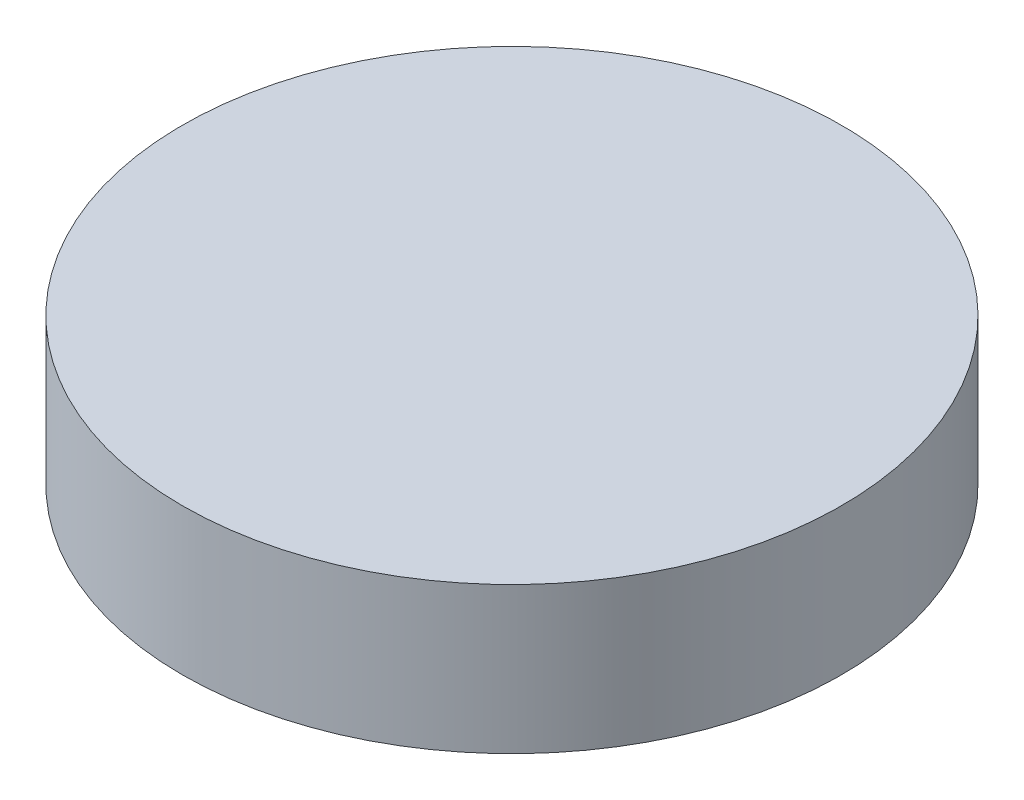
ISO-10303-21;
HEADER;
FILE_DESCRIPTION(('STEP AP214'),'2;1');
FILE_NAME('part.step','',(''),(''),'','','');
FILE_SCHEMA(('AUTOMOTIVE_DESIGN { 1 0 10303 214 1 1 1 1 }'));
ENDSEC;
DATA;
#1=APPLICATION_CONTEXT('core data for automotive mechanical design processes');
#2=APPLICATION_PROTOCOL_DEFINITION('international standard','automotive_design',2000,#1);
#3=PRODUCT_CONTEXT('',#1,'mechanical');
#4=PRODUCT('Part','Part','',(#3));
#5=PRODUCT_RELATED_PRODUCT_CATEGORY('part','',(#4));
#6=PRODUCT_DEFINITION_FORMATION('','',#4);
#7=PRODUCT_DEFINITION_CONTEXT('part definition',#1,'design');
#8=PRODUCT_DEFINITION('design','',#6,#7);
#9=PRODUCT_DEFINITION_SHAPE('','',#8);
#10=(LENGTH_UNIT() NAMED_UNIT(*) SI_UNIT(.MILLI.,.METRE.));
#11=(NAMED_UNIT(*) PLANE_ANGLE_UNIT() SI_UNIT($,.RADIAN.));
#12=(NAMED_UNIT(*) SI_UNIT($,.STERADIAN.) SOLID_ANGLE_UNIT());
#13=UNCERTAINTY_MEASURE_WITH_UNIT(LENGTH_MEASURE(1.E-05),#10,'distance_accuracy_value','');
#14=(GEOMETRIC_REPRESENTATION_CONTEXT(3) GLOBAL_UNCERTAINTY_ASSIGNED_CONTEXT((#13)) GLOBAL_UNIT_ASSIGNED_CONTEXT((#10,
#11,#12)) REPRESENTATION_CONTEXT('',''));
#15=CARTESIAN_POINT('',(0.,0.,0.));
#16=DIRECTION('',(0.,0.,1.));
#17=DIRECTION('',(1.,0.,0.));
#18=AXIS2_PLACEMENT_3D('',#15,#16,#17);
#19=CARTESIAN_POINT('',(0.,50.8,0.));
#20=DIRECTION('',(0.,-1.,0.));
#21=DIRECTION('',(0.,0.,-1.));
#22=AXIS2_PLACEMENT_3D('',#19,#20,#21);
#23=CYLINDRICAL_SURFACE('',#22,114.3);
#24=CARTESIAN_POINT('',(0.,50.8,0.));
#25=DIRECTION('',(0.,1.,0.));
#26=DIRECTION('',(0.,0.,1.));
#27=AXIS2_PLACEMENT_3D('',#24,#25,#26);
#28=CIRCLE('',#27,114.3);
#29=CARTESIAN_POINT('',(0.,50.8,114.3));
#30=VERTEX_POINT('',#29);
#31=EDGE_CURVE('E10',#30,#30,#28,.T.);
#32=ORIENTED_EDGE('',*,*,#31,.F.);
#33=EDGE_LOOP('',(#32));
#34=FACE_BOUND('',#33,.T.);
#35=CARTESIAN_POINT('',(0.,0.,0.));
#36=DIRECTION('',(0.,1.,0.));
#37=DIRECTION('',(0.,0.,1.));
#38=AXIS2_PLACEMENT_3D('',#35,#36,#37);
#39=CIRCLE('',#38,114.3);
#40=CARTESIAN_POINT('',(0.,0.,114.3));
#41=VERTEX_POINT('',#40);
#42=EDGE_CURVE('E36',#41,#41,#39,.T.);
#43=ORIENTED_EDGE('',*,*,#42,.T.);
#44=EDGE_LOOP('',(#43));
#45=FACE_BOUND('',#44,.T.);
#46=ADVANCED_FACE('F33',(#34,#45),#23,.T.);
#47=CARTESIAN_POINT('',(0.,50.8,0.));
#48=DIRECTION('',(0.,1.,0.));
#49=DIRECTION('',(0.,0.,1.));
#50=AXIS2_PLACEMENT_3D('',#47,#48,#49);
#51=PLANE('',#50);
#52=ORIENTED_EDGE('',*,*,#31,.T.);
#53=EDGE_LOOP('',(#52));
#54=FACE_BOUND('',#53,.T.);
#55=ADVANCED_FACE('F48',(#54),#51,.T.);
#56=CARTESIAN_POINT('',(0.,0.,0.));
#57=DIRECTION('',(0.,1.,0.));
#58=DIRECTION('',(0.,0.,1.));
#59=AXIS2_PLACEMENT_3D('',#56,#57,#58);
#60=PLANE('',#59);
#61=ORIENTED_EDGE('',*,*,#42,.F.);
#62=EDGE_LOOP('',(#61));
#63=FACE_BOUND('',#62,.T.);
#64=ADVANCED_FACE('F46',(#63),#60,.F.);
#65=CLOSED_SHELL('',(#46,#55,#64));
#66=MANIFOLD_SOLID_BREP('B2',#65);
#67=ADVANCED_BREP_SHAPE_REPRESENTATION('',(#18,#66),#14);
#68=SHAPE_DEFINITION_REPRESENTATION(#9,#67);
ENDSEC;
END-ISO-10303-21;
